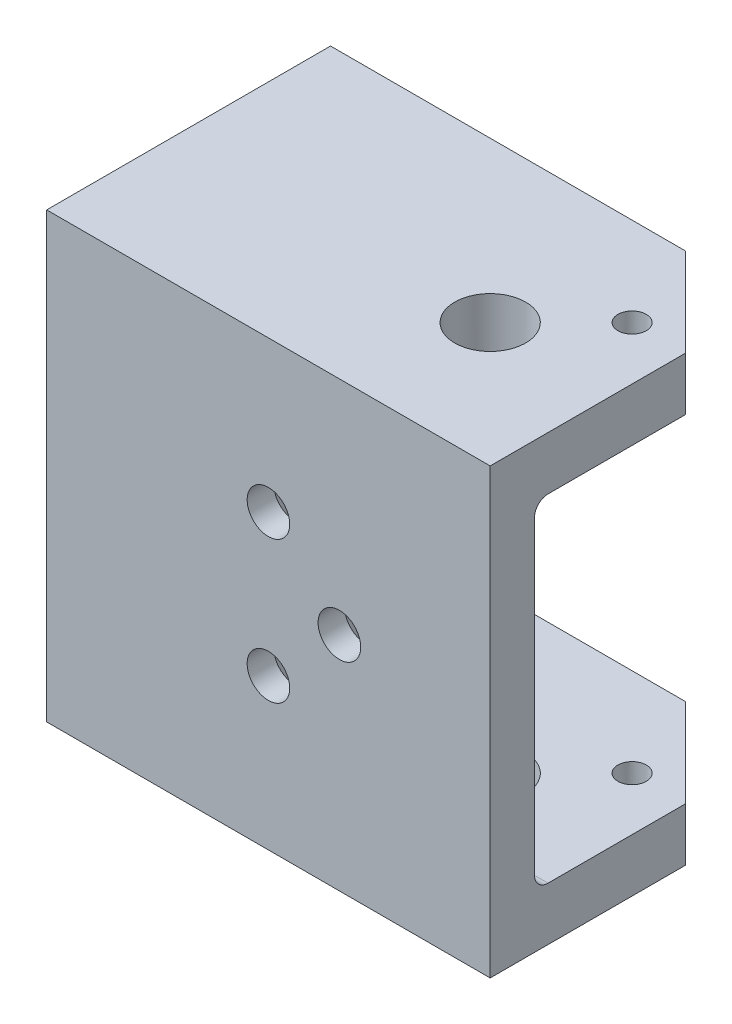
ISO-10303-21;
HEADER;
FILE_DESCRIPTION(('STEP AP214'),'2;1');
FILE_NAME('part.step','',(''),(''),'','','');
FILE_SCHEMA(('AUTOMOTIVE_DESIGN { 1 0 10303 214 1 1 1 1 }'));
ENDSEC;
DATA;
#1=APPLICATION_CONTEXT('core data for automotive mechanical design processes');
#2=APPLICATION_PROTOCOL_DEFINITION('international standard','automotive_design',2000,#1);
#3=PRODUCT_CONTEXT('',#1,'mechanical');
#4=PRODUCT('Part','Part','',(#3));
#5=PRODUCT_RELATED_PRODUCT_CATEGORY('part','',(#4));
#6=PRODUCT_DEFINITION_FORMATION('','',#4);
#7=PRODUCT_DEFINITION_CONTEXT('part definition',#1,'design');
#8=PRODUCT_DEFINITION('design','',#6,#7);
#9=PRODUCT_DEFINITION_SHAPE('','',#8);
#10=(LENGTH_UNIT() NAMED_UNIT(*) SI_UNIT(.MILLI.,.METRE.));
#11=(NAMED_UNIT(*) PLANE_ANGLE_UNIT() SI_UNIT($,.RADIAN.));
#12=(NAMED_UNIT(*) SI_UNIT($,.STERADIAN.) SOLID_ANGLE_UNIT());
#13=UNCERTAINTY_MEASURE_WITH_UNIT(LENGTH_MEASURE(1.E-05),#10,'distance_accuracy_value','');
#14=(GEOMETRIC_REPRESENTATION_CONTEXT(3) GLOBAL_UNCERTAINTY_ASSIGNED_CONTEXT((#13)) GLOBAL_UNIT_ASSIGNED_CONTEXT((#10,
#11,#12)) REPRESENTATION_CONTEXT('',''));
#15=CARTESIAN_POINT('',(0.,0.,0.));
#16=DIRECTION('',(0.,0.,1.));
#17=DIRECTION('',(1.,0.,0.));
#18=AXIS2_PLACEMENT_3D('',#15,#16,#17);
#19=CARTESIAN_POINT('',(0.,0.,0.));
#20=DIRECTION('',(0.,0.,1.));
#21=DIRECTION('',(1.,0.,0.));
#22=AXIS2_PLACEMENT_3D('',#19,#20,#21);
#23=PLANE('',#22);
#24=CARTESIAN_POINT('',(0.,4.,0.));
#25=DIRECTION('',(0.,0.,-1.));
#26=DIRECTION('',(-1.,0.,0.));
#27=AXIS2_PLACEMENT_3D('',#24,#25,#26);
#28=CIRCLE('',#27,2.2);
#29=CARTESIAN_POINT('',(-2.2,4.,0.));
#30=VERTEX_POINT('',#29);
#31=EDGE_CURVE('E295',#30,#30,#28,.T.);
#32=ORIENTED_EDGE('',*,*,#31,.F.);
#33=EDGE_LOOP('',(#32));
#34=FACE_BOUND('',#33,.T.);
#35=CARTESIAN_POINT('',(0.,-4.,0.));
#36=DIRECTION('',(0.,0.,-1.));
#37=DIRECTION('',(-1.,0.,0.));
#38=AXIS2_PLACEMENT_3D('',#35,#36,#37);
#39=CIRCLE('',#38,2.2);
#40=CARTESIAN_POINT('',(-2.2,-4.,0.));
#41=VERTEX_POINT('',#40);
#42=EDGE_CURVE('E286',#41,#41,#39,.T.);
#43=ORIENTED_EDGE('',*,*,#42,.F.);
#44=EDGE_LOOP('',(#43));
#45=FACE_BOUND('',#44,.T.);
#46=CARTESIAN_POINT('',(4.,0.,0.));
#47=DIRECTION('',(0.,0.,-1.));
#48=DIRECTION('',(-1.,0.,0.));
#49=AXIS2_PLACEMENT_3D('',#46,#47,#48);
#50=CIRCLE('',#49,2.2);
#51=CARTESIAN_POINT('',(1.8,0.,0.));
#52=VERTEX_POINT('',#51);
#53=EDGE_CURVE('E277',#52,#52,#50,.T.);
#54=ORIENTED_EDGE('',*,*,#53,.F.);
#55=EDGE_LOOP('',(#54));
#56=FACE_BOUND('',#55,.T.);
#57=DIRECTION('',(0.,-1.,0.));
#58=VECTOR('',#57,1.);
#59=CARTESIAN_POINT('',(-12.5,12.5,0.));
#60=LINE('',#59,#58);
#61=CARTESIAN_POINT('',(-12.5,8.738,0.));
#62=VERTEX_POINT('',#61);
#63=CARTESIAN_POINT('',(-12.5,-8.738,0.));
#64=VERTEX_POINT('',#63);
#65=EDGE_CURVE('E176',#62,#64,#60,.T.);
#66=ORIENTED_EDGE('',*,*,#65,.F.);
#67=DIRECTION('',(-1.,0.,0.));
#68=VECTOR('',#67,1.);
#69=CARTESIAN_POINT('',(12.5,8.738,0.));
#70=LINE('',#69,#68);
#71=CARTESIAN_POINT('',(12.5,8.738,0.));
#72=VERTEX_POINT('',#71);
#73=EDGE_CURVE('E208',#62,#72,#70,.F.);
#74=ORIENTED_EDGE('',*,*,#73,.T.);
#75=DIRECTION('',(0.,1.,0.));
#76=VECTOR('',#75,1.);
#77=CARTESIAN_POINT('',(12.5,12.5,0.));
#78=LINE('',#77,#76);
#79=CARTESIAN_POINT('',(12.5,-8.73800000000001,0.));
#80=VERTEX_POINT('',#79);
#81=EDGE_CURVE('E171',#80,#72,#78,.T.);
#82=ORIENTED_EDGE('',*,*,#81,.F.);
#83=DIRECTION('',(1.,0.,0.));
#84=VECTOR('',#83,1.);
#85=CARTESIAN_POINT('',(-12.5,-8.738,0.));
#86=LINE('',#85,#84);
#87=EDGE_CURVE('E206',#80,#64,#86,.F.);
#88=ORIENTED_EDGE('',*,*,#87,.T.);
#89=EDGE_LOOP('',(#66,#74,#82,#88));
#90=FACE_BOUND('',#89,.T.);
#91=ADVANCED_FACE('F36',(#34,#45,#56,#90),#23,.F.);
#92=CARTESIAN_POINT('',(12.5,12.5,2.5));
#93=DIRECTION('',(-1.,0.,0.));
#94=DIRECTION('',(0.,-1.,0.));
#95=AXIS2_PLACEMENT_3D('',#92,#93,#94);
#96=PLANE('',#95);
#97=DIRECTION('',(0.,0.,-1.));
#98=VECTOR('',#97,1.);
#99=CARTESIAN_POINT('',(12.5,-12.5,2.5));
#100=LINE('',#99,#98);
#101=CARTESIAN_POINT('',(12.5,-12.5,2.5));
#102=VERTEX_POINT('',#101);
#103=CARTESIAN_POINT('',(12.5,-12.5,-8.49999999999998));
#104=VERTEX_POINT('',#103);
#105=EDGE_CURVE('E182',#102,#104,#100,.T.);
#106=ORIENTED_EDGE('',*,*,#105,.T.);
#107=DIRECTION('',(0.,1.,0.));
#108=VECTOR('',#107,1.);
#109=CARTESIAN_POINT('',(12.5,-9.50000000000001,-8.49999999999998));
#110=LINE('',#109,#108);
#111=CARTESIAN_POINT('',(12.5,-9.50000000000001,-8.49999999999998));
#112=VERTEX_POINT('',#111);
#113=EDGE_CURVE('E226',#104,#112,#110,.T.);
#114=ORIENTED_EDGE('',*,*,#113,.T.);
#115=DIRECTION('',(0.,0.,1.));
#116=VECTOR('',#115,1.);
#117=CARTESIAN_POINT('',(12.5,-9.50000000000001,-13.5));
#118=LINE('',#117,#116);
#119=CARTESIAN_POINT('',(12.5,-9.50000000000001,-0.762000000000001));
#120=VERTEX_POINT('',#119);
#121=EDGE_CURVE('E155',#112,#120,#118,.T.);
#122=ORIENTED_EDGE('',*,*,#121,.T.);
#123=CARTESIAN_POINT('',(12.5,-8.738,-0.762000000000001));
#124=DIRECTION('',(-1.,0.,0.));
#125=DIRECTION('',(0.,-1.,0.));
#126=AXIS2_PLACEMENT_3D('',#123,#124,#125);
#127=CIRCLE('',#126,0.762);
#128=EDGE_CURVE('E217',#120,#80,#127,.T.);
#129=ORIENTED_EDGE('',*,*,#128,.T.);
#130=ORIENTED_EDGE('',*,*,#81,.T.);
#131=CARTESIAN_POINT('',(12.5,8.738,-0.762000000000001));
#132=DIRECTION('',(-1.,0.,0.));
#133=DIRECTION('',(0.,-1.,0.));
#134=AXIS2_PLACEMENT_3D('',#131,#132,#133);
#135=CIRCLE('',#134,0.762);
#136=CARTESIAN_POINT('',(12.5,9.5,-0.762000000000001));
#137=VERTEX_POINT('',#136);
#138=EDGE_CURVE('E214',#72,#137,#135,.T.);
#139=ORIENTED_EDGE('',*,*,#138,.T.);
#140=DIRECTION('',(0.,0.,1.));
#141=VECTOR('',#140,1.);
#142=CARTESIAN_POINT('',(12.5,9.5,-13.5));
#143=LINE('',#142,#141);
#144=CARTESIAN_POINT('',(12.5,9.5,-8.49999999999998));
#145=VERTEX_POINT('',#144);
#146=EDGE_CURVE('E169',#145,#137,#143,.T.);
#147=ORIENTED_EDGE('',*,*,#146,.F.);
#148=DIRECTION('',(0.,1.,0.));
#149=VECTOR('',#148,1.);
#150=CARTESIAN_POINT('',(12.5,12.5,-8.49999999999998));
#151=LINE('',#150,#149);
#152=CARTESIAN_POINT('',(12.5,12.5,-8.49999999999998));
#153=VERTEX_POINT('',#152);
#154=EDGE_CURVE('E224',#145,#153,#151,.T.);
#155=ORIENTED_EDGE('',*,*,#154,.T.);
#156=DIRECTION('',(0.,0.,-1.));
#157=VECTOR('',#156,1.);
#158=CARTESIAN_POINT('',(12.5,12.5,2.5));
#159=LINE('',#158,#157);
#160=CARTESIAN_POINT('',(12.5,12.5,2.5));
#161=VERTEX_POINT('',#160);
#162=EDGE_CURVE('E192',#161,#153,#159,.T.);
#163=ORIENTED_EDGE('',*,*,#162,.F.);
#164=DIRECTION('',(0.,1.,0.));
#165=VECTOR('',#164,1.);
#166=CARTESIAN_POINT('',(12.5,12.5,2.5));
#167=LINE('',#166,#165);
#168=EDGE_CURVE('E172',#102,#161,#167,.T.);
#169=ORIENTED_EDGE('',*,*,#168,.F.);
#170=EDGE_LOOP('',(#106,#114,#122,#129,#130,#139,#147,#155,#163,#169));
#171=FACE_BOUND('',#170,.T.);
#172=ADVANCED_FACE('F236',(#171),#96,.F.);
#173=CARTESIAN_POINT('',(-12.5,12.5,2.5));
#174=DIRECTION('',(0.,-1.,0.));
#175=DIRECTION('',(0.,0.,-1.));
#176=AXIS2_PLACEMENT_3D('',#173,#174,#175);
#177=PLANE('',#176);
#178=CARTESIAN_POINT('',(9.5,12.5,-8.5));
#179=DIRECTION('',(0.,-1.,0.));
#180=DIRECTION('',(0.,0.,-1.));
#181=AXIS2_PLACEMENT_3D('',#178,#179,#180);
#182=CIRCLE('',#181,0.800000000000001);
#183=CARTESIAN_POINT('',(9.5,12.5,-9.3));
#184=VERTEX_POINT('',#183);
#185=EDGE_CURVE('E203',#184,#184,#182,.T.);
#186=ORIENTED_EDGE('',*,*,#185,.T.);
#187=EDGE_LOOP('',(#186));
#188=FACE_BOUND('',#187,.T.);
#189=CARTESIAN_POINT('',(5.5,12.5,-4.5));
#190=DIRECTION('',(0.,-1.,0.));
#191=DIRECTION('',(0.,0.,-1.));
#192=AXIS2_PLACEMENT_3D('',#189,#190,#191);
#193=CIRCLE('',#192,2.);
#194=CARTESIAN_POINT('',(5.5,12.5,-6.5));
#195=VERTEX_POINT('',#194);
#196=EDGE_CURVE('E198',#195,#195,#193,.T.);
#197=ORIENTED_EDGE('',*,*,#196,.T.);
#198=EDGE_LOOP('',(#197));
#199=FACE_BOUND('',#198,.T.);
#200=ORIENTED_EDGE('',*,*,#162,.T.);
#201=DIRECTION('',(0.707106781186546,0.,0.707106781186549));
#202=VECTOR('',#201,1.);
#203=CARTESIAN_POINT('',(7.49999999999999,12.5,-13.5));
#204=LINE('',#203,#202);
#205=CARTESIAN_POINT('',(7.49999999999999,12.5,-13.5));
#206=VERTEX_POINT('',#205);
#207=EDGE_CURVE('E11',#153,#206,#204,.F.);
#208=ORIENTED_EDGE('',*,*,#207,.T.);
#209=DIRECTION('',(1.,0.,0.));
#210=VECTOR('',#209,1.);
#211=CARTESIAN_POINT('',(-12.5,12.5,-13.5));
#212=LINE('',#211,#210);
#213=CARTESIAN_POINT('',(-12.5,12.5,-13.5));
#214=VERTEX_POINT('',#213);
#215=EDGE_CURVE('E158',#214,#206,#212,.T.);
#216=ORIENTED_EDGE('',*,*,#215,.F.);
#217=DIRECTION('',(0.,0.,-1.));
#218=VECTOR('',#217,1.);
#219=CARTESIAN_POINT('',(-12.5,12.5,2.5));
#220=LINE('',#219,#218);
#221=CARTESIAN_POINT('',(-12.5,12.5,2.5));
#222=VERTEX_POINT('',#221);
#223=EDGE_CURVE('E190',#222,#214,#220,.T.);
#224=ORIENTED_EDGE('',*,*,#223,.F.);
#225=DIRECTION('',(-1.,0.,0.));
#226=VECTOR('',#225,1.);
#227=CARTESIAN_POINT('',(-12.5,12.5,2.5));
#228=LINE('',#227,#226);
#229=EDGE_CURVE('E175',#161,#222,#228,.T.);
#230=ORIENTED_EDGE('',*,*,#229,.F.);
#231=EDGE_LOOP('',(#200,#208,#216,#224,#230));
#232=FACE_BOUND('',#231,.T.);
#233=ADVANCED_FACE('F244',(#188,#199,#232),#177,.F.);
#234=CARTESIAN_POINT('',(-12.5,12.5,2.5));
#235=DIRECTION('',(1.,0.,0.));
#236=DIRECTION('',(0.,1.,0.));
#237=AXIS2_PLACEMENT_3D('',#234,#235,#236);
#238=PLANE('',#237);
#239=ORIENTED_EDGE('',*,*,#223,.T.);
#240=DIRECTION('',(0.,1.,0.));
#241=VECTOR('',#240,1.);
#242=CARTESIAN_POINT('',(-12.5,12.5,-13.5));
#243=LINE('',#242,#241);
#244=CARTESIAN_POINT('',(-12.5,9.5,-13.5));
#245=VERTEX_POINT('',#244);
#246=EDGE_CURVE('E154',#245,#214,#243,.T.);
#247=ORIENTED_EDGE('',*,*,#246,.F.);
#248=DIRECTION('',(0.,0.,1.));
#249=VECTOR('',#248,1.);
#250=CARTESIAN_POINT('',(-12.5,9.5,-13.5));
#251=LINE('',#250,#249);
#252=CARTESIAN_POINT('',(-12.5,9.5,-0.762000000000001));
#253=VERTEX_POINT('',#252);
#254=EDGE_CURVE('E166',#245,#253,#251,.T.);
#255=ORIENTED_EDGE('',*,*,#254,.T.);
#256=CARTESIAN_POINT('',(-12.5,8.738,-0.762000000000001));
#257=DIRECTION('',(1.,0.,0.));
#258=DIRECTION('',(0.,1.,0.));
#259=AXIS2_PLACEMENT_3D('',#256,#257,#258);
#260=CIRCLE('',#259,0.762);
#261=EDGE_CURVE('E212',#253,#62,#260,.T.);
#262=ORIENTED_EDGE('',*,*,#261,.T.);
#263=ORIENTED_EDGE('',*,*,#65,.T.);
#264=CARTESIAN_POINT('',(-12.5,-8.738,-0.762000000000001));
#265=DIRECTION('',(1.,0.,0.));
#266=DIRECTION('',(0.,1.,0.));
#267=AXIS2_PLACEMENT_3D('',#264,#265,#266);
#268=CIRCLE('',#267,0.762);
#269=CARTESIAN_POINT('',(-12.5,-9.5,-0.762000000000001));
#270=VERTEX_POINT('',#269);
#271=EDGE_CURVE('E153',#64,#270,#268,.T.);
#272=ORIENTED_EDGE('',*,*,#271,.T.);
#273=DIRECTION('',(0.,0.,1.));
#274=VECTOR('',#273,1.);
#275=CARTESIAN_POINT('',(-12.5,-9.5,-13.5));
#276=LINE('',#275,#274);
#277=CARTESIAN_POINT('',(-12.5,-9.5,-13.5));
#278=VERTEX_POINT('',#277);
#279=EDGE_CURVE('E132',#278,#270,#276,.T.);
#280=ORIENTED_EDGE('',*,*,#279,.F.);
#281=DIRECTION('',(0.,1.,0.));
#282=VECTOR('',#281,1.);
#283=CARTESIAN_POINT('',(-12.5,-12.5,-13.5));
#284=LINE('',#283,#282);
#285=CARTESIAN_POINT('',(-12.5,-12.5,-13.5));
#286=VERTEX_POINT('',#285);
#287=EDGE_CURVE('E140',#286,#278,#284,.T.);
#288=ORIENTED_EDGE('',*,*,#287,.F.);
#289=DIRECTION('',(0.,0.,-1.));
#290=VECTOR('',#289,1.);
#291=CARTESIAN_POINT('',(-12.5,-12.5,2.5));
#292=LINE('',#291,#290);
#293=CARTESIAN_POINT('',(-12.5,-12.5,2.5));
#294=VERTEX_POINT('',#293);
#295=EDGE_CURVE('E188',#294,#286,#292,.T.);
#296=ORIENTED_EDGE('',*,*,#295,.F.);
#297=DIRECTION('',(0.,-1.,0.));
#298=VECTOR('',#297,1.);
#299=CARTESIAN_POINT('',(-12.5,12.5,2.5));
#300=LINE('',#299,#298);
#301=EDGE_CURVE('E178',#222,#294,#300,.T.);
#302=ORIENTED_EDGE('',*,*,#301,.F.);
#303=EDGE_LOOP('',(#239,#247,#255,#262,#263,#272,#280,#288,#296,#302));
#304=FACE_BOUND('',#303,.T.);
#305=ADVANCED_FACE('F150',(#304),#238,.F.);
#306=CARTESIAN_POINT('',(-12.5,-12.5,2.5));
#307=DIRECTION('',(0.,1.,0.));
#308=DIRECTION('',(0.,0.,1.));
#309=AXIS2_PLACEMENT_3D('',#306,#307,#308);
#310=PLANE('',#309);
#311=CARTESIAN_POINT('',(9.5,-12.5,-8.5));
#312=DIRECTION('',(0.,-1.,0.));
#313=DIRECTION('',(0.,0.,-1.));
#314=AXIS2_PLACEMENT_3D('',#311,#312,#313);
#315=CIRCLE('',#314,0.800000000000001);
#316=CARTESIAN_POINT('',(9.5,-12.5,-9.3));
#317=VERTEX_POINT('',#316);
#318=EDGE_CURVE('E266',#317,#317,#315,.T.);
#319=ORIENTED_EDGE('',*,*,#318,.F.);
#320=EDGE_LOOP('',(#319));
#321=FACE_BOUND('',#320,.T.);
#322=CARTESIAN_POINT('',(5.5,-12.5,-4.5));
#323=DIRECTION('',(0.,-1.,0.));
#324=DIRECTION('',(0.,0.,-1.));
#325=AXIS2_PLACEMENT_3D('',#322,#323,#324);
#326=CIRCLE('',#325,2.);
#327=CARTESIAN_POINT('',(5.5,-12.5,-6.5));
#328=VERTEX_POINT('',#327);
#329=EDGE_CURVE('E259',#328,#328,#326,.T.);
#330=ORIENTED_EDGE('',*,*,#329,.F.);
#331=EDGE_LOOP('',(#330));
#332=FACE_BOUND('',#331,.T.);
#333=DIRECTION('',(-1.,0.,0.));
#334=VECTOR('',#333,1.);
#335=CARTESIAN_POINT('',(-12.5,-12.5,-13.5));
#336=LINE('',#335,#334);
#337=CARTESIAN_POINT('',(7.5,-12.5,-13.5));
#338=VERTEX_POINT('',#337);
#339=EDGE_CURVE('E139',#338,#286,#336,.T.);
#340=ORIENTED_EDGE('',*,*,#339,.F.);
#341=DIRECTION('',(0.707106781186546,0.,0.707106781186549));
#342=VECTOR('',#341,1.);
#343=CARTESIAN_POINT('',(7.5,-12.5,-13.5));
#344=LINE('',#343,#342);
#345=EDGE_CURVE('E222',#338,#104,#344,.T.);
#346=ORIENTED_EDGE('',*,*,#345,.T.);
#347=ORIENTED_EDGE('',*,*,#105,.F.);
#348=DIRECTION('',(1.,0.,0.));
#349=VECTOR('',#348,1.);
#350=CARTESIAN_POINT('',(-12.5,-12.5,2.5));
#351=LINE('',#350,#349);
#352=EDGE_CURVE('E180',#294,#102,#351,.T.);
#353=ORIENTED_EDGE('',*,*,#352,.F.);
#354=ORIENTED_EDGE('',*,*,#295,.T.);
#355=EDGE_LOOP('',(#340,#346,#347,#353,#354));
#356=FACE_BOUND('',#355,.T.);
#357=ADVANCED_FACE('F255',(#321,#332,#356),#310,.F.);
#358=CARTESIAN_POINT('',(0.,0.,2.5));
#359=DIRECTION('',(0.,0.,1.));
#360=DIRECTION('',(1.,0.,0.));
#361=AXIS2_PLACEMENT_3D('',#358,#359,#360);
#362=PLANE('',#361);
#363=CARTESIAN_POINT('',(0.,4.,2.5));
#364=DIRECTION('',(0.,0.,-1.));
#365=DIRECTION('',(-1.,0.,0.));
#366=AXIS2_PLACEMENT_3D('',#363,#364,#365);
#367=CIRCLE('',#366,1.2);
#368=CARTESIAN_POINT('',(-1.2,4.,2.5));
#369=VERTEX_POINT('',#368);
#370=EDGE_CURVE('E289',#369,#369,#367,.T.);
#371=ORIENTED_EDGE('',*,*,#370,.T.);
#372=EDGE_LOOP('',(#371));
#373=FACE_BOUND('',#372,.T.);
#374=CARTESIAN_POINT('',(0.,-4.,2.5));
#375=DIRECTION('',(0.,0.,-1.));
#376=DIRECTION('',(-1.,0.,0.));
#377=AXIS2_PLACEMENT_3D('',#374,#375,#376);
#378=CIRCLE('',#377,1.2);
#379=CARTESIAN_POINT('',(-1.2,-4.,2.5));
#380=VERTEX_POINT('',#379);
#381=EDGE_CURVE('E280',#380,#380,#378,.T.);
#382=ORIENTED_EDGE('',*,*,#381,.T.);
#383=EDGE_LOOP('',(#382));
#384=FACE_BOUND('',#383,.T.);
#385=CARTESIAN_POINT('',(4.,0.,2.5));
#386=DIRECTION('',(0.,0.,-1.));
#387=DIRECTION('',(-1.,0.,0.));
#388=AXIS2_PLACEMENT_3D('',#385,#386,#387);
#389=CIRCLE('',#388,1.2);
#390=CARTESIAN_POINT('',(2.8,0.,2.5));
#391=VERTEX_POINT('',#390);
#392=EDGE_CURVE('E269',#391,#391,#389,.T.);
#393=ORIENTED_EDGE('',*,*,#392,.T.);
#394=EDGE_LOOP('',(#393));
#395=FACE_BOUND('',#394,.T.);
#396=ORIENTED_EDGE('',*,*,#168,.T.);
#397=ORIENTED_EDGE('',*,*,#229,.T.);
#398=ORIENTED_EDGE('',*,*,#301,.T.);
#399=ORIENTED_EDGE('',*,*,#352,.T.);
#400=EDGE_LOOP('',(#396,#397,#398,#399));
#401=FACE_BOUND('',#400,.T.);
#402=ADVANCED_FACE('F248',(#373,#384,#395,#401),#362,.T.);
#403=CARTESIAN_POINT('',(-12.5,9.5,-13.5));
#404=DIRECTION('',(0.,1.,0.));
#405=DIRECTION('',(-1.,0.,0.));
#406=AXIS2_PLACEMENT_3D('',#403,#404,#405);
#407=PLANE('',#406);
#408=CARTESIAN_POINT('',(9.5,9.5,-8.5));
#409=DIRECTION('',(0.,1.,0.));
#410=DIRECTION('',(-1.,0.,0.));
#411=AXIS2_PLACEMENT_3D('',#408,#409,#410);
#412=CIRCLE('',#411,0.800000000000001);
#413=CARTESIAN_POINT('',(8.7,9.5,-8.5));
#414=VERTEX_POINT('',#413);
#415=EDGE_CURVE('E202',#414,#414,#412,.T.);
#416=ORIENTED_EDGE('',*,*,#415,.T.);
#417=EDGE_LOOP('',(#416));
#418=FACE_BOUND('',#417,.T.);
#419=CARTESIAN_POINT('',(5.5,9.5,-4.5));
#420=DIRECTION('',(0.,1.,0.));
#421=DIRECTION('',(-1.,0.,0.));
#422=AXIS2_PLACEMENT_3D('',#419,#420,#421);
#423=CIRCLE('',#422,2.);
#424=CARTESIAN_POINT('',(3.5,9.5,-4.5));
#425=VERTEX_POINT('',#424);
#426=EDGE_CURVE('E148',#425,#425,#423,.T.);
#427=ORIENTED_EDGE('',*,*,#426,.T.);
#428=EDGE_LOOP('',(#427));
#429=FACE_BOUND('',#428,.T.);
#430=DIRECTION('',(-1.,0.,0.));
#431=VECTOR('',#430,1.);
#432=CARTESIAN_POINT('',(-12.5,9.5,-13.5));
#433=LINE('',#432,#431);
#434=CARTESIAN_POINT('',(7.49999999999998,9.5,-13.5));
#435=VERTEX_POINT('',#434);
#436=EDGE_CURVE('E164',#435,#245,#433,.T.);
#437=ORIENTED_EDGE('',*,*,#436,.F.);
#438=DIRECTION('',(-0.707106781186546,0.,-0.707106781186549));
#439=VECTOR('',#438,1.);
#440=CARTESIAN_POINT('',(7.49999999999999,9.5,-13.5));
#441=LINE('',#440,#439);
#442=EDGE_CURVE('E45',#435,#145,#441,.F.);
#443=ORIENTED_EDGE('',*,*,#442,.T.);
#444=ORIENTED_EDGE('',*,*,#146,.T.);
#445=DIRECTION('',(-1.,0.,0.));
#446=VECTOR('',#445,1.);
#447=CARTESIAN_POINT('',(-12.5,9.5,-0.762000000000001));
#448=LINE('',#447,#446);
#449=EDGE_CURVE('E194',#137,#253,#448,.T.);
#450=ORIENTED_EDGE('',*,*,#449,.T.);
#451=ORIENTED_EDGE('',*,*,#254,.F.);
#452=EDGE_LOOP('',(#437,#443,#444,#450,#451));
#453=FACE_BOUND('',#452,.T.);
#454=ADVANCED_FACE('F233',(#418,#429,#453),#407,.F.);
#455=CARTESIAN_POINT('',(0.,0.,-13.5));
#456=DIRECTION('',(0.,0.,1.));
#457=DIRECTION('',(1.,0.,0.));
#458=AXIS2_PLACEMENT_3D('',#455,#456,#457);
#459=PLANE('',#458);
#460=ORIENTED_EDGE('',*,*,#215,.T.);
#461=DIRECTION('',(0.,-1.,0.));
#462=VECTOR('',#461,1.);
#463=CARTESIAN_POINT('',(7.49999999999999,0.,-13.5));
#464=LINE('',#463,#462);
#465=EDGE_CURVE('E229',#206,#435,#464,.T.);
#466=ORIENTED_EDGE('',*,*,#465,.T.);
#467=ORIENTED_EDGE('',*,*,#436,.T.);
#468=ORIENTED_EDGE('',*,*,#246,.T.);
#469=EDGE_LOOP('',(#460,#466,#467,#468));
#470=FACE_BOUND('',#469,.T.);
#471=ADVANCED_FACE('F241',(#470),#459,.F.);
#472=CARTESIAN_POINT('',(-12.5,-9.5,-13.5));
#473=DIRECTION('',(0.,-1.,0.));
#474=DIRECTION('',(1.,0.,0.));
#475=AXIS2_PLACEMENT_3D('',#472,#473,#474);
#476=PLANE('',#475);
#477=CARTESIAN_POINT('',(9.5,-9.50000000000001,-8.5));
#478=DIRECTION('',(0.,-1.,0.));
#479=DIRECTION('',(1.,0.,0.));
#480=AXIS2_PLACEMENT_3D('',#477,#478,#479);
#481=CIRCLE('',#480,0.800000000000001);
#482=CARTESIAN_POINT('',(10.3,-9.50000000000001,-8.5));
#483=VERTEX_POINT('',#482);
#484=EDGE_CURVE('E199',#483,#483,#481,.T.);
#485=ORIENTED_EDGE('',*,*,#484,.T.);
#486=EDGE_LOOP('',(#485));
#487=FACE_BOUND('',#486,.T.);
#488=CARTESIAN_POINT('',(5.5,-9.50000000000001,-4.5));
#489=DIRECTION('',(0.,-1.,0.));
#490=DIRECTION('',(1.,0.,0.));
#491=AXIS2_PLACEMENT_3D('',#488,#489,#490);
#492=CIRCLE('',#491,2.);
#493=CARTESIAN_POINT('',(7.5,-9.50000000000001,-4.5));
#494=VERTEX_POINT('',#493);
#495=EDGE_CURVE('E195',#494,#494,#492,.T.);
#496=ORIENTED_EDGE('',*,*,#495,.T.);
#497=EDGE_LOOP('',(#496));
#498=FACE_BOUND('',#497,.T.);
#499=ORIENTED_EDGE('',*,*,#121,.F.);
#500=DIRECTION('',(-0.707106781186546,0.,-0.707106781186549));
#501=VECTOR('',#500,1.);
#502=CARTESIAN_POINT('',(7.49999999999999,-9.50000000000001,-13.5));
#503=LINE('',#502,#501);
#504=CARTESIAN_POINT('',(7.49999999999999,-9.50000000000001,-13.5));
#505=VERTEX_POINT('',#504);
#506=EDGE_CURVE('E135',#112,#505,#503,.T.);
#507=ORIENTED_EDGE('',*,*,#506,.T.);
#508=DIRECTION('',(1.,0.,0.));
#509=VECTOR('',#508,1.);
#510=CARTESIAN_POINT('',(-12.5,-9.5,-13.5));
#511=LINE('',#510,#509);
#512=EDGE_CURVE('E126',#278,#505,#511,.T.);
#513=ORIENTED_EDGE('',*,*,#512,.F.);
#514=ORIENTED_EDGE('',*,*,#279,.T.);
#515=DIRECTION('',(1.,0.,0.));
#516=VECTOR('',#515,1.);
#517=CARTESIAN_POINT('',(12.5,-9.50000000000001,-0.762000000000001));
#518=LINE('',#517,#516);
#519=EDGE_CURVE('E210',#270,#120,#518,.T.);
#520=ORIENTED_EDGE('',*,*,#519,.T.);
#521=EDGE_LOOP('',(#499,#507,#513,#514,#520));
#522=FACE_BOUND('',#521,.T.);
#523=ADVANCED_FACE('F129',(#487,#498,#522),#476,.F.);
#524=CARTESIAN_POINT('',(0.,0.,-13.5));
#525=DIRECTION('',(0.,0.,-1.));
#526=DIRECTION('',(-1.,0.,0.));
#527=AXIS2_PLACEMENT_3D('',#524,#525,#526);
#528=PLANE('',#527);
#529=ORIENTED_EDGE('',*,*,#512,.T.);
#530=DIRECTION('',(0.,-1.,0.));
#531=VECTOR('',#530,1.);
#532=CARTESIAN_POINT('',(7.5,-12.5,-13.5));
#533=LINE('',#532,#531);
#534=EDGE_CURVE('E220',#505,#338,#533,.T.);
#535=ORIENTED_EDGE('',*,*,#534,.T.);
#536=ORIENTED_EDGE('',*,*,#339,.T.);
#537=ORIENTED_EDGE('',*,*,#287,.T.);
#538=EDGE_LOOP('',(#529,#535,#536,#537));
#539=FACE_BOUND('',#538,.T.);
#540=ADVANCED_FACE('F143',(#539),#528,.T.);
#541=CARTESIAN_POINT('',(5.5,12.5,-4.5));
#542=DIRECTION('',(0.,-1.,0.));
#543=DIRECTION('',(0.,0.,-1.));
#544=AXIS2_PLACEMENT_3D('',#541,#542,#543);
#545=CYLINDRICAL_SURFACE('',#544,2.);
#546=ORIENTED_EDGE('',*,*,#329,.T.);
#547=EDGE_LOOP('',(#546));
#548=FACE_BOUND('',#547,.T.);
#549=ORIENTED_EDGE('',*,*,#495,.F.);
#550=EDGE_LOOP('',(#549));
#551=FACE_BOUND('',#550,.T.);
#552=ADVANCED_FACE('F356',(#548,#551),#545,.F.);
#553=ORIENTED_EDGE('',*,*,#196,.F.);
#554=EDGE_LOOP('',(#553));
#555=FACE_BOUND('',#554,.T.);
#556=ORIENTED_EDGE('',*,*,#426,.F.);
#557=EDGE_LOOP('',(#556));
#558=FACE_BOUND('',#557,.T.);
#559=ADVANCED_FACE('F353',(#555,#558),#545,.F.);
#560=CARTESIAN_POINT('',(9.5,12.5,-8.5));
#561=DIRECTION('',(0.,-1.,0.));
#562=DIRECTION('',(0.,0.,-1.));
#563=AXIS2_PLACEMENT_3D('',#560,#561,#562);
#564=CYLINDRICAL_SURFACE('',#563,0.800000000000001);
#565=ORIENTED_EDGE('',*,*,#318,.T.);
#566=EDGE_LOOP('',(#565));
#567=FACE_BOUND('',#566,.T.);
#568=ORIENTED_EDGE('',*,*,#484,.F.);
#569=EDGE_LOOP('',(#568));
#570=FACE_BOUND('',#569,.T.);
#571=ADVANCED_FACE('F324',(#567,#570),#564,.F.);
#572=ORIENTED_EDGE('',*,*,#185,.F.);
#573=EDGE_LOOP('',(#572));
#574=FACE_BOUND('',#573,.T.);
#575=ORIENTED_EDGE('',*,*,#415,.F.);
#576=EDGE_LOOP('',(#575));
#577=FACE_BOUND('',#576,.T.);
#578=ADVANCED_FACE('F316',(#574,#577),#564,.F.);
#579=CARTESIAN_POINT('',(-12.5,8.738,-0.762000000000001));
#580=DIRECTION('',(1.,0.,0.));
#581=DIRECTION('',(0.,1.,0.));
#582=AXIS2_PLACEMENT_3D('',#579,#580,#581);
#583=CYLINDRICAL_SURFACE('',#582,0.762);
#584=ORIENTED_EDGE('',*,*,#138,.F.);
#585=ORIENTED_EDGE('',*,*,#73,.F.);
#586=ORIENTED_EDGE('',*,*,#261,.F.);
#587=ORIENTED_EDGE('',*,*,#449,.F.);
#588=EDGE_LOOP('',(#584,#585,#586,#587));
#589=FACE_BOUND('',#588,.T.);
#590=ADVANCED_FACE('F313',(#589),#583,.F.);
#591=CARTESIAN_POINT('',(-12.5,-8.738,-0.762000000000001));
#592=DIRECTION('',(-1.,0.,0.));
#593=DIRECTION('',(0.,-1.,0.));
#594=AXIS2_PLACEMENT_3D('',#591,#592,#593);
#595=CYLINDRICAL_SURFACE('',#594,0.762);
#596=ORIENTED_EDGE('',*,*,#271,.F.);
#597=ORIENTED_EDGE('',*,*,#87,.F.);
#598=ORIENTED_EDGE('',*,*,#128,.F.);
#599=ORIENTED_EDGE('',*,*,#519,.F.);
#600=EDGE_LOOP('',(#596,#597,#598,#599));
#601=FACE_BOUND('',#600,.T.);
#602=ADVANCED_FACE('F315',(#601),#595,.F.);
#603=CARTESIAN_POINT('',(7.49999999999999,0.,-13.5));
#604=DIRECTION('',(0.707106781186549,0.,-0.707106781186546));
#605=DIRECTION('',(0.,1.,0.));
#606=AXIS2_PLACEMENT_3D('',#603,#604,#605);
#607=PLANE('',#606);
#608=ORIENTED_EDGE('',*,*,#506,.F.);
#609=ORIENTED_EDGE('',*,*,#113,.F.);
#610=ORIENTED_EDGE('',*,*,#345,.F.);
#611=ORIENTED_EDGE('',*,*,#534,.F.);
#612=EDGE_LOOP('',(#608,#609,#610,#611));
#613=FACE_BOUND('',#612,.T.);
#614=ADVANCED_FACE('F254',(#613),#607,.T.);
#615=CARTESIAN_POINT('',(7.49999999999999,0.,-13.5));
#616=DIRECTION('',(-0.707106781186549,0.,0.707106781186546));
#617=DIRECTION('',(0.,-1.,0.));
#618=AXIS2_PLACEMENT_3D('',#615,#616,#617);
#619=PLANE('',#618);
#620=ORIENTED_EDGE('',*,*,#207,.F.);
#621=ORIENTED_EDGE('',*,*,#154,.F.);
#622=ORIENTED_EDGE('',*,*,#442,.F.);
#623=ORIENTED_EDGE('',*,*,#465,.F.);
#624=EDGE_LOOP('',(#620,#621,#622,#623));
#625=FACE_BOUND('',#624,.T.);
#626=ADVANCED_FACE('F39',(#625),#619,.F.);
#627=CARTESIAN_POINT('',(4.,0.,0.));
#628=DIRECTION('',(0.,0.,-1.));
#629=DIRECTION('',(-1.,0.,0.));
#630=AXIS2_PLACEMENT_3D('',#627,#628,#629);
#631=CYLINDRICAL_SURFACE('',#630,1.2);
#632=ORIENTED_EDGE('',*,*,#392,.F.);
#633=EDGE_LOOP('',(#632));
#634=FACE_BOUND('',#633,.T.);
#635=CARTESIAN_POINT('',(4.,0.,1.));
#636=DIRECTION('',(0.,0.,-1.));
#637=DIRECTION('',(-1.,0.,0.));
#638=AXIS2_PLACEMENT_3D('',#635,#636,#637);
#639=CIRCLE('',#638,1.2);
#640=CARTESIAN_POINT('',(2.8,0.,1.));
#641=VERTEX_POINT('',#640);
#642=EDGE_CURVE('E274',#641,#641,#639,.T.);
#643=ORIENTED_EDGE('',*,*,#642,.T.);
#644=EDGE_LOOP('',(#643));
#645=FACE_BOUND('',#644,.T.);
#646=ADVANCED_FACE('F336',(#634,#645),#631,.F.);
#647=CARTESIAN_POINT('',(4.,0.,0.));
#648=DIRECTION('',(0.,0.,-1.));
#649=DIRECTION('',(-1.,0.,0.));
#650=AXIS2_PLACEMENT_3D('',#647,#648,#649);
#651=CONICAL_SURFACE('',#650,2.2,0.785398163397449);
#652=ORIENTED_EDGE('',*,*,#642,.F.);
#653=EDGE_LOOP('',(#652));
#654=FACE_BOUND('',#653,.T.);
#655=ORIENTED_EDGE('',*,*,#53,.T.);
#656=EDGE_LOOP('',(#655));
#657=FACE_BOUND('',#656,.T.);
#658=ADVANCED_FACE('F340',(#654,#657),#651,.F.);
#659=CARTESIAN_POINT('',(0.,-4.,0.));
#660=DIRECTION('',(0.,0.,-1.));
#661=DIRECTION('',(-1.,0.,0.));
#662=AXIS2_PLACEMENT_3D('',#659,#660,#661);
#663=CYLINDRICAL_SURFACE('',#662,1.2);
#664=ORIENTED_EDGE('',*,*,#381,.F.);
#665=EDGE_LOOP('',(#664));
#666=FACE_BOUND('',#665,.T.);
#667=CARTESIAN_POINT('',(0.,-4.,1.));
#668=DIRECTION('',(0.,0.,-1.));
#669=DIRECTION('',(-1.,0.,0.));
#670=AXIS2_PLACEMENT_3D('',#667,#668,#669);
#671=CIRCLE('',#670,1.2);
#672=CARTESIAN_POINT('',(-1.2,-4.,1.));
#673=VERTEX_POINT('',#672);
#674=EDGE_CURVE('E283',#673,#673,#671,.T.);
#675=ORIENTED_EDGE('',*,*,#674,.T.);
#676=EDGE_LOOP('',(#675));
#677=FACE_BOUND('',#676,.T.);
#678=ADVANCED_FACE('F346',(#666,#677),#663,.F.);
#679=CARTESIAN_POINT('',(0.,-4.,0.));
#680=DIRECTION('',(0.,0.,-1.));
#681=DIRECTION('',(-1.,0.,0.));
#682=AXIS2_PLACEMENT_3D('',#679,#680,#681);
#683=CONICAL_SURFACE('',#682,2.2,0.785398163397449);
#684=ORIENTED_EDGE('',*,*,#674,.F.);
#685=EDGE_LOOP('',(#684));
#686=FACE_BOUND('',#685,.T.);
#687=ORIENTED_EDGE('',*,*,#42,.T.);
#688=EDGE_LOOP('',(#687));
#689=FACE_BOUND('',#688,.T.);
#690=ADVANCED_FACE('F424',(#686,#689),#683,.F.);
#691=CARTESIAN_POINT('',(0.,4.,0.));
#692=DIRECTION('',(0.,0.,-1.));
#693=DIRECTION('',(-1.,0.,0.));
#694=AXIS2_PLACEMENT_3D('',#691,#692,#693);
#695=CYLINDRICAL_SURFACE('',#694,1.2);
#696=ORIENTED_EDGE('',*,*,#370,.F.);
#697=EDGE_LOOP('',(#696));
#698=FACE_BOUND('',#697,.T.);
#699=CARTESIAN_POINT('',(0.,4.,1.));
#700=DIRECTION('',(0.,0.,-1.));
#701=DIRECTION('',(-1.,0.,0.));
#702=AXIS2_PLACEMENT_3D('',#699,#700,#701);
#703=CIRCLE('',#702,1.2);
#704=CARTESIAN_POINT('',(-1.2,4.,1.));
#705=VERTEX_POINT('',#704);
#706=EDGE_CURVE('E292',#705,#705,#703,.T.);
#707=ORIENTED_EDGE('',*,*,#706,.T.);
#708=EDGE_LOOP('',(#707));
#709=FACE_BOUND('',#708,.T.);
#710=ADVANCED_FACE('F433',(#698,#709),#695,.F.);
#711=CARTESIAN_POINT('',(0.,4.,0.));
#712=DIRECTION('',(0.,0.,-1.));
#713=DIRECTION('',(-1.,0.,0.));
#714=AXIS2_PLACEMENT_3D('',#711,#712,#713);
#715=CONICAL_SURFACE('',#714,2.2,0.785398163397449);
#716=ORIENTED_EDGE('',*,*,#706,.F.);
#717=EDGE_LOOP('',(#716));
#718=FACE_BOUND('',#717,.T.);
#719=ORIENTED_EDGE('',*,*,#31,.T.);
#720=EDGE_LOOP('',(#719));
#721=FACE_BOUND('',#720,.T.);
#722=ADVANCED_FACE('F299',(#718,#721),#715,.F.);
#723=CLOSED_SHELL('',(#91,#172,#233,#305,#357,#402,#454,#471,#523,#540,#552,#559,#571,#578,#590,
#602,#614,#626,#646,#658,#678,#690,#710,#722));
#724=MANIFOLD_SOLID_BREP('B2',#723);
#725=ADVANCED_BREP_SHAPE_REPRESENTATION('',(#18,#724),#14);
#726=SHAPE_DEFINITION_REPRESENTATION(#9,#725);
ENDSEC;
END-ISO-10303-21;
